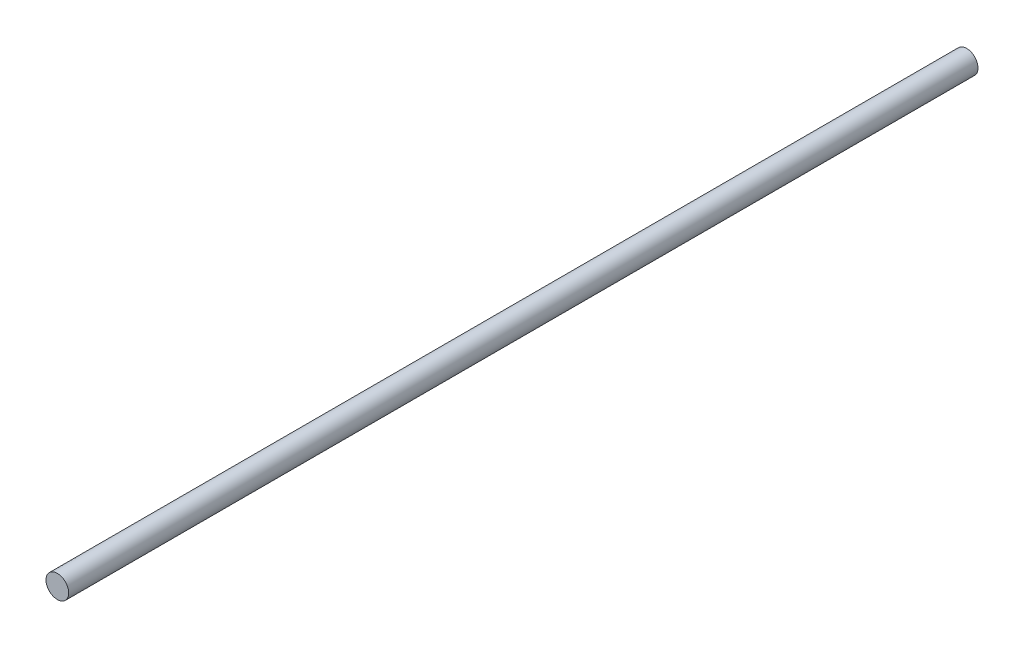
ISO-10303-21;
HEADER;
FILE_DESCRIPTION(('STEP AP214'),'2;1');
FILE_NAME('part.step','',(''),(''),'','','');
FILE_SCHEMA(('AUTOMOTIVE_DESIGN { 1 0 10303 214 1 1 1 1 }'));
ENDSEC;
DATA;
#1=APPLICATION_CONTEXT('core data for automotive mechanical design processes');
#2=APPLICATION_PROTOCOL_DEFINITION('international standard','automotive_design',2000,#1);
#3=PRODUCT_CONTEXT('',#1,'mechanical');
#4=PRODUCT('Part','Part','',(#3));
#5=PRODUCT_RELATED_PRODUCT_CATEGORY('part','',(#4));
#6=PRODUCT_DEFINITION_FORMATION('','',#4);
#7=PRODUCT_DEFINITION_CONTEXT('part definition',#1,'design');
#8=PRODUCT_DEFINITION('design','',#6,#7);
#9=PRODUCT_DEFINITION_SHAPE('','',#8);
#10=(LENGTH_UNIT() NAMED_UNIT(*) SI_UNIT(.MILLI.,.METRE.));
#11=(NAMED_UNIT(*) PLANE_ANGLE_UNIT() SI_UNIT($,.RADIAN.));
#12=(NAMED_UNIT(*) SI_UNIT($,.STERADIAN.) SOLID_ANGLE_UNIT());
#13=UNCERTAINTY_MEASURE_WITH_UNIT(LENGTH_MEASURE(1.E-05),#10,'distance_accuracy_value','');
#14=(GEOMETRIC_REPRESENTATION_CONTEXT(3) GLOBAL_UNCERTAINTY_ASSIGNED_CONTEXT((#13)) GLOBAL_UNIT_ASSIGNED_CONTEXT((#10,
#11,#12)) REPRESENTATION_CONTEXT('',''));
#15=CARTESIAN_POINT('',(0.,0.,0.));
#16=DIRECTION('',(0.,0.,1.));
#17=DIRECTION('',(1.,0.,0.));
#18=AXIS2_PLACEMENT_3D('',#15,#16,#17);
#19=CARTESIAN_POINT('',(0.,0.,300.));
#20=DIRECTION('',(0.,0.,-1.));
#21=DIRECTION('',(-1.,0.,0.));
#22=AXIS2_PLACEMENT_3D('',#19,#20,#21);
#23=CYLINDRICAL_SURFACE('',#22,3.75);
#24=CARTESIAN_POINT('',(0.,0.,300.));
#25=DIRECTION('',(0.,0.,1.));
#26=DIRECTION('',(1.,0.,0.));
#27=AXIS2_PLACEMENT_3D('',#24,#25,#26);
#28=CIRCLE('',#27,3.75);
#29=CARTESIAN_POINT('',(3.75,0.,300.));
#30=VERTEX_POINT('',#29);
#31=EDGE_CURVE('E10',#30,#30,#28,.T.);
#32=ORIENTED_EDGE('',*,*,#31,.F.);
#33=EDGE_LOOP('',(#32));
#34=FACE_BOUND('',#33,.T.);
#35=CARTESIAN_POINT('',(0.,0.,0.));
#36=DIRECTION('',(0.,0.,1.));
#37=DIRECTION('',(1.,0.,0.));
#38=AXIS2_PLACEMENT_3D('',#35,#36,#37);
#39=CIRCLE('',#38,3.75);
#40=CARTESIAN_POINT('',(3.75,0.,0.));
#41=VERTEX_POINT('',#40);
#42=EDGE_CURVE('E34',#41,#41,#39,.T.);
#43=ORIENTED_EDGE('',*,*,#42,.T.);
#44=EDGE_LOOP('',(#43));
#45=FACE_BOUND('',#44,.T.);
#46=ADVANCED_FACE('F31',(#34,#45),#23,.T.);
#47=CARTESIAN_POINT('',(0.,0.,300.));
#48=DIRECTION('',(0.,0.,1.));
#49=DIRECTION('',(1.,0.,0.));
#50=AXIS2_PLACEMENT_3D('',#47,#48,#49);
#51=PLANE('',#50);
#52=ORIENTED_EDGE('',*,*,#31,.T.);
#53=EDGE_LOOP('',(#52));
#54=FACE_BOUND('',#53,.T.);
#55=ADVANCED_FACE('F46',(#54),#51,.T.);
#56=CARTESIAN_POINT('',(0.,0.,0.));
#57=DIRECTION('',(0.,0.,1.));
#58=DIRECTION('',(1.,0.,0.));
#59=AXIS2_PLACEMENT_3D('',#56,#57,#58);
#60=PLANE('',#59);
#61=ORIENTED_EDGE('',*,*,#42,.F.);
#62=EDGE_LOOP('',(#61));
#63=FACE_BOUND('',#62,.T.);
#64=ADVANCED_FACE('F44',(#63),#60,.F.);
#65=CLOSED_SHELL('',(#46,#55,#64));
#66=MANIFOLD_SOLID_BREP('B2',#65);
#67=ADVANCED_BREP_SHAPE_REPRESENTATION('',(#18,#66),#14);
#68=SHAPE_DEFINITION_REPRESENTATION(#9,#67);
ENDSEC;
END-ISO-10303-21;
